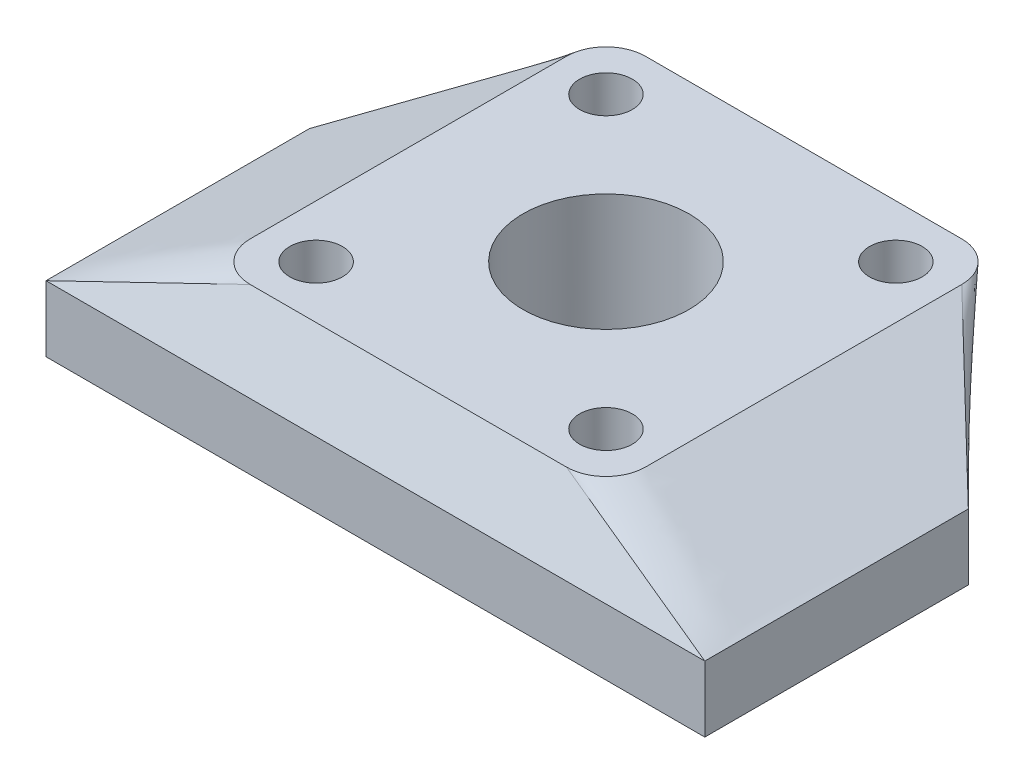
ISO-10303-21;
HEADER;
FILE_DESCRIPTION(('STEP AP214'),'2;1');
FILE_NAME('part.step','',(''),(''),'','','');
FILE_SCHEMA(('AUTOMOTIVE_DESIGN { 1 0 10303 214 1 1 1 1 }'));
ENDSEC;
DATA;
#1=APPLICATION_CONTEXT('core data for automotive mechanical design processes');
#2=APPLICATION_PROTOCOL_DEFINITION('international standard','automotive_design',2000,#1);
#3=PRODUCT_CONTEXT('',#1,'mechanical');
#4=PRODUCT('Part','Part','',(#3));
#5=PRODUCT_RELATED_PRODUCT_CATEGORY('part','',(#4));
#6=PRODUCT_DEFINITION_FORMATION('','',#4);
#7=PRODUCT_DEFINITION_CONTEXT('part definition',#1,'design');
#8=PRODUCT_DEFINITION('design','',#6,#7);
#9=PRODUCT_DEFINITION_SHAPE('','',#8);
#10=(LENGTH_UNIT() NAMED_UNIT(*) SI_UNIT(.MILLI.,.METRE.));
#11=(NAMED_UNIT(*) PLANE_ANGLE_UNIT() SI_UNIT($,.RADIAN.));
#12=(NAMED_UNIT(*) SI_UNIT($,.STERADIAN.) SOLID_ANGLE_UNIT());
#13=UNCERTAINTY_MEASURE_WITH_UNIT(LENGTH_MEASURE(1.E-05),#10,'distance_accuracy_value','');
#14=(GEOMETRIC_REPRESENTATION_CONTEXT(3) GLOBAL_UNCERTAINTY_ASSIGNED_CONTEXT((#13)) GLOBAL_UNIT_ASSIGNED_CONTEXT((#10,
#11,#12)) REPRESENTATION_CONTEXT('',''));
#15=CARTESIAN_POINT('',(0.,0.,0.));
#16=DIRECTION('',(0.,0.,1.));
#17=DIRECTION('',(1.,0.,0.));
#18=AXIS2_PLACEMENT_3D('',#15,#16,#17);
#19=CARTESIAN_POINT('',(-10.,5.,-35.));
#20=DIRECTION('',(0.707106781186547,0.,0.707106781186548));
#21=DIRECTION('',(0.707106781186548,0.,-0.707106781186547));
#22=AXIS2_PLACEMENT_3D('',#19,#20,#21);
#23=PLANE('',#22);
#24=DIRECTION('',(-0.707106781186548,0.,0.707106781186547));
#25=VECTOR('',#24,1.);
#26=CARTESIAN_POINT('',(-10.,0.,-35.));
#27=LINE('',#26,#25);
#28=CARTESIAN_POINT('',(-10.,0.,-35.));
#29=VERTEX_POINT('',#28);
#30=CARTESIAN_POINT('',(-25.,0.,-20.));
#31=VERTEX_POINT('',#30);
#32=EDGE_CURVE('E374',#29,#31,#27,.T.);
#33=ORIENTED_EDGE('',*,*,#32,.T.);
#34=DIRECTION('',(0.,-1.,0.));
#35=VECTOR('',#34,1.);
#36=CARTESIAN_POINT('',(-25.,5.,-20.));
#37=LINE('',#36,#35);
#38=CARTESIAN_POINT('',(-25.,5.,-20.));
#39=VERTEX_POINT('',#38);
#40=EDGE_CURVE('E13',#39,#31,#37,.T.);
#41=ORIENTED_EDGE('',*,*,#40,.F.);
#42=DIRECTION('',(0.707106781186548,0.,-0.707106781186547));
#43=VECTOR('',#42,1.);
#44=CARTESIAN_POINT('',(-10.,5.,-35.));
#45=LINE('',#44,#43);
#46=CARTESIAN_POINT('',(-10.,5.,-35.));
#47=VERTEX_POINT('',#46);
#48=EDGE_CURVE('E491',#47,#39,#45,.F.);
#49=ORIENTED_EDGE('',*,*,#48,.F.);
#50=DIRECTION('',(0.,-1.,0.));
#51=VECTOR('',#50,1.);
#52=CARTESIAN_POINT('',(-10.,5.,-35.));
#53=LINE('',#52,#51);
#54=EDGE_CURVE('E177',#47,#29,#53,.T.);
#55=ORIENTED_EDGE('',*,*,#54,.T.);
#56=EDGE_LOOP('',(#33,#41,#49,#55));
#57=FACE_BOUND('',#56,.T.);
#58=ADVANCED_FACE('F159',(#57),#23,.F.);
#59=CARTESIAN_POINT('',(-25.,5.,-20.));
#60=DIRECTION('',(1.,0.,0.));
#61=DIRECTION('',(0.,0.,-1.));
#62=AXIS2_PLACEMENT_3D('',#59,#60,#61);
#63=PLANE('',#62);
#64=DIRECTION('',(0.,0.,1.));
#65=VECTOR('',#64,1.);
#66=CARTESIAN_POINT('',(-25.,0.,-20.));
#67=LINE('',#66,#65);
#68=CARTESIAN_POINT('',(-25.,0.,0.));
#69=VERTEX_POINT('',#68);
#70=EDGE_CURVE('E544',#31,#69,#67,.T.);
#71=ORIENTED_EDGE('',*,*,#70,.T.);
#72=DIRECTION('',(0.,-1.,0.));
#73=VECTOR('',#72,1.);
#74=CARTESIAN_POINT('',(-25.,5.,0.));
#75=LINE('',#74,#73);
#76=CARTESIAN_POINT('',(-25.,5.,0.));
#77=VERTEX_POINT('',#76);
#78=EDGE_CURVE('E168',#77,#69,#75,.T.);
#79=ORIENTED_EDGE('',*,*,#78,.F.);
#80=DIRECTION('',(0.,0.,-1.));
#81=VECTOR('',#80,1.);
#82=CARTESIAN_POINT('',(-25.,5.,-20.));
#83=LINE('',#82,#81);
#84=EDGE_CURVE('E230',#39,#77,#83,.F.);
#85=ORIENTED_EDGE('',*,*,#84,.F.);
#86=ORIENTED_EDGE('',*,*,#40,.T.);
#87=EDGE_LOOP('',(#71,#79,#85,#86));
#88=FACE_BOUND('',#87,.T.);
#89=ADVANCED_FACE('F557',(#88),#63,.F.);
#90=CARTESIAN_POINT('',(-25.,5.,0.));
#91=DIRECTION('',(0.,0.,-1.));
#92=DIRECTION('',(-1.,0.,0.));
#93=AXIS2_PLACEMENT_3D('',#90,#91,#92);
#94=PLANE('',#93);
#95=DIRECTION('',(1.,0.,0.));
#96=VECTOR('',#95,1.);
#97=CARTESIAN_POINT('',(-25.,0.,0.));
#98=LINE('',#97,#96);
#99=CARTESIAN_POINT('',(25.,0.,0.));
#100=VERTEX_POINT('',#99);
#101=EDGE_CURVE('E204',#69,#100,#98,.T.);
#102=ORIENTED_EDGE('',*,*,#101,.T.);
#103=DIRECTION('',(0.,-1.,0.));
#104=VECTOR('',#103,1.);
#105=CARTESIAN_POINT('',(25.,5.,0.));
#106=LINE('',#105,#104);
#107=CARTESIAN_POINT('',(25.,5.,0.));
#108=VERTEX_POINT('',#107);
#109=EDGE_CURVE('E195',#108,#100,#106,.T.);
#110=ORIENTED_EDGE('',*,*,#109,.F.);
#111=DIRECTION('',(-1.,0.,0.));
#112=VECTOR('',#111,1.);
#113=CARTESIAN_POINT('',(12.,5.,0.));
#114=LINE('',#113,#112);
#115=EDGE_CURVE('E200',#77,#108,#114,.F.);
#116=ORIENTED_EDGE('',*,*,#115,.F.);
#117=ORIENTED_EDGE('',*,*,#78,.T.);
#118=EDGE_LOOP('',(#102,#110,#116,#117));
#119=FACE_BOUND('',#118,.T.);
#120=ADVANCED_FACE('F197',(#119),#94,.F.);
#121=CARTESIAN_POINT('',(25.,5.,0.));
#122=DIRECTION('',(-1.,0.,0.));
#123=DIRECTION('',(0.,0.,1.));
#124=AXIS2_PLACEMENT_3D('',#121,#122,#123);
#125=PLANE('',#124);
#126=DIRECTION('',(0.,0.,-1.));
#127=VECTOR('',#126,1.);
#128=CARTESIAN_POINT('',(25.,0.,0.));
#129=LINE('',#128,#127);
#130=CARTESIAN_POINT('',(25.,0.,-20.));
#131=VERTEX_POINT('',#130);
#132=EDGE_CURVE('E551',#100,#131,#129,.T.);
#133=ORIENTED_EDGE('',*,*,#132,.T.);
#134=DIRECTION('',(0.,-1.,0.));
#135=VECTOR('',#134,1.);
#136=CARTESIAN_POINT('',(25.,5.,-20.));
#137=LINE('',#136,#135);
#138=CARTESIAN_POINT('',(25.,5.,-20.));
#139=VERTEX_POINT('',#138);
#140=EDGE_CURVE('E208',#139,#131,#137,.T.);
#141=ORIENTED_EDGE('',*,*,#140,.F.);
#142=DIRECTION('',(0.,0.,1.));
#143=VECTOR('',#142,1.);
#144=CARTESIAN_POINT('',(25.,5.,0.));
#145=LINE('',#144,#143);
#146=EDGE_CURVE('E212',#108,#139,#145,.F.);
#147=ORIENTED_EDGE('',*,*,#146,.F.);
#148=ORIENTED_EDGE('',*,*,#109,.T.);
#149=EDGE_LOOP('',(#133,#141,#147,#148));
#150=FACE_BOUND('',#149,.T.);
#151=ADVANCED_FACE('F213',(#150),#125,.F.);
#152=CARTESIAN_POINT('',(25.,5.,-20.));
#153=DIRECTION('',(-0.707106781186548,0.,0.707106781186548));
#154=DIRECTION('',(0.707106781186548,0.,0.707106781186548));
#155=AXIS2_PLACEMENT_3D('',#152,#153,#154);
#156=PLANE('',#155);
#157=DIRECTION('',(-0.707106781186547,0.,-0.707106781186547));
#158=VECTOR('',#157,1.);
#159=CARTESIAN_POINT('',(25.,0.,-20.));
#160=LINE('',#159,#158);
#161=CARTESIAN_POINT('',(10.,0.,-35.));
#162=VERTEX_POINT('',#161);
#163=EDGE_CURVE('E539',#131,#162,#160,.T.);
#164=ORIENTED_EDGE('',*,*,#163,.T.);
#165=DIRECTION('',(0.,-1.,0.));
#166=VECTOR('',#165,1.);
#167=CARTESIAN_POINT('',(10.,5.,-35.));
#168=LINE('',#167,#166);
#169=CARTESIAN_POINT('',(10.,5.,-35.));
#170=VERTEX_POINT('',#169);
#171=EDGE_CURVE('E488',#170,#162,#168,.T.);
#172=ORIENTED_EDGE('',*,*,#171,.F.);
#173=DIRECTION('',(0.707106781186548,0.,0.707106781186548));
#174=VECTOR('',#173,1.);
#175=CARTESIAN_POINT('',(25.,5.,-20.));
#176=LINE('',#175,#174);
#177=EDGE_CURVE('E219',#139,#170,#176,.F.);
#178=ORIENTED_EDGE('',*,*,#177,.F.);
#179=ORIENTED_EDGE('',*,*,#140,.T.);
#180=EDGE_LOOP('',(#164,#172,#178,#179));
#181=FACE_BOUND('',#180,.T.);
#182=ADVANCED_FACE('F556',(#181),#156,.F.);
#183=CARTESIAN_POINT('',(10.,5.,-35.));
#184=DIRECTION('',(0.,0.,1.));
#185=DIRECTION('',(1.,0.,0.));
#186=AXIS2_PLACEMENT_3D('',#183,#184,#185);
#187=PLANE('',#186);
#188=DIRECTION('',(-1.,0.,0.));
#189=VECTOR('',#188,1.);
#190=CARTESIAN_POINT('',(10.,0.,-35.));
#191=LINE('',#190,#189);
#192=EDGE_CURVE('E494',#162,#29,#191,.T.);
#193=ORIENTED_EDGE('',*,*,#192,.T.);
#194=ORIENTED_EDGE('',*,*,#54,.F.);
#195=DIRECTION('',(1.,0.,0.));
#196=VECTOR('',#195,1.);
#197=CARTESIAN_POINT('',(-12.,5.,-35.));
#198=LINE('',#197,#196);
#199=EDGE_CURVE('E484',#170,#47,#198,.F.);
#200=ORIENTED_EDGE('',*,*,#199,.F.);
#201=ORIENTED_EDGE('',*,*,#171,.T.);
#202=EDGE_LOOP('',(#193,#194,#200,#201));
#203=FACE_BOUND('',#202,.T.);
#204=ADVANCED_FACE('F535',(#203),#187,.F.);
#205=CARTESIAN_POINT('',(0.,0.,0.));
#206=DIRECTION('',(0.,-1.,0.));
#207=DIRECTION('',(0.,0.,-1.));
#208=AXIS2_PLACEMENT_3D('',#205,#206,#207);
#209=PLANE('',#208);
#210=CARTESIAN_POINT('',(11.,0.,-28.5));
#211=DIRECTION('',(0.,1.,0.));
#212=DIRECTION('',(0.,0.,1.));
#213=AXIS2_PLACEMENT_3D('',#210,#211,#212);
#214=CIRCLE('',#213,2.00000000000001);
#215=CARTESIAN_POINT('',(11.,0.,-26.5));
#216=VERTEX_POINT('',#215);
#217=EDGE_CURVE('E577',#216,#216,#214,.T.);
#218=ORIENTED_EDGE('',*,*,#217,.T.);
#219=EDGE_LOOP('',(#218));
#220=FACE_BOUND('',#219,.T.);
#221=CARTESIAN_POINT('',(-11.,0.,-6.49999999999999));
#222=DIRECTION('',(0.,1.,0.));
#223=DIRECTION('',(0.,0.,1.));
#224=AXIS2_PLACEMENT_3D('',#221,#222,#223);
#225=CIRCLE('',#224,2.);
#226=CARTESIAN_POINT('',(-11.,0.,-4.49999999999999));
#227=VERTEX_POINT('',#226);
#228=EDGE_CURVE('E581',#227,#227,#225,.T.);
#229=ORIENTED_EDGE('',*,*,#228,.T.);
#230=EDGE_LOOP('',(#229));
#231=FACE_BOUND('',#230,.T.);
#232=CARTESIAN_POINT('',(11.,0.,-6.49999999999998));
#233=DIRECTION('',(0.,1.,0.));
#234=DIRECTION('',(0.,0.,1.));
#235=AXIS2_PLACEMENT_3D('',#232,#233,#234);
#236=CIRCLE('',#235,2.);
#237=CARTESIAN_POINT('',(11.,0.,-4.49999999999998));
#238=VERTEX_POINT('',#237);
#239=EDGE_CURVE('E585',#238,#238,#236,.T.);
#240=ORIENTED_EDGE('',*,*,#239,.T.);
#241=EDGE_LOOP('',(#240));
#242=FACE_BOUND('',#241,.T.);
#243=CARTESIAN_POINT('',(0.,0.,-17.5));
#244=DIRECTION('',(0.,1.,0.));
#245=DIRECTION('',(0.,0.,1.));
#246=AXIS2_PLACEMENT_3D('',#243,#244,#245);
#247=CIRCLE('',#246,6.3);
#248=CARTESIAN_POINT('',(0.,0.,-11.2));
#249=VERTEX_POINT('',#248);
#250=EDGE_CURVE('E589',#249,#249,#247,.T.);
#251=ORIENTED_EDGE('',*,*,#250,.T.);
#252=EDGE_LOOP('',(#251));
#253=FACE_BOUND('',#252,.T.);
#254=CARTESIAN_POINT('',(-11.,0.,-28.5));
#255=DIRECTION('',(0.,1.,0.));
#256=DIRECTION('',(0.,0.,1.));
#257=AXIS2_PLACEMENT_3D('',#254,#255,#256);
#258=CIRCLE('',#257,2.);
#259=CARTESIAN_POINT('',(-11.,0.,-26.5));
#260=VERTEX_POINT('',#259);
#261=EDGE_CURVE('E500',#260,#260,#258,.T.);
#262=ORIENTED_EDGE('',*,*,#261,.T.);
#263=EDGE_LOOP('',(#262));
#264=FACE_BOUND('',#263,.T.);
#265=ORIENTED_EDGE('',*,*,#32,.F.);
#266=ORIENTED_EDGE('',*,*,#192,.F.);
#267=ORIENTED_EDGE('',*,*,#163,.F.);
#268=ORIENTED_EDGE('',*,*,#132,.F.);
#269=ORIENTED_EDGE('',*,*,#101,.F.);
#270=ORIENTED_EDGE('',*,*,#70,.F.);
#271=EDGE_LOOP('',(#265,#266,#267,#268,#269,#270));
#272=FACE_BOUND('',#271,.T.);
#273=ADVANCED_FACE('F420',(#220,#231,#242,#253,#264,#272),#209,.T.);
#274=CARTESIAN_POINT('',(-12.,10.,-5.5));
#275=DIRECTION('',(0.,-1.,0.));
#276=DIRECTION('',(0.,0.,-1.));
#277=AXIS2_PLACEMENT_3D('',#274,#275,#276);
#278=PLANE('',#277);
#279=CARTESIAN_POINT('',(11.,10.,-28.5));
#280=DIRECTION('',(0.,-1.,0.));
#281=DIRECTION('',(0.,0.,-1.));
#282=AXIS2_PLACEMENT_3D('',#279,#280,#281);
#283=CIRCLE('',#282,2.00000000000001);
#284=CARTESIAN_POINT('',(11.,10.,-30.5));
#285=VERTEX_POINT('',#284);
#286=EDGE_CURVE('E162',#285,#285,#283,.F.);
#287=ORIENTED_EDGE('',*,*,#286,.F.);
#288=EDGE_LOOP('',(#287));
#289=FACE_BOUND('',#288,.T.);
#290=CARTESIAN_POINT('',(-11.,10.,-6.49999999999999));
#291=DIRECTION('',(0.,-1.,0.));
#292=DIRECTION('',(0.,0.,-1.));
#293=AXIS2_PLACEMENT_3D('',#290,#291,#292);
#294=CIRCLE('',#293,2.);
#295=CARTESIAN_POINT('',(-11.,10.,-8.49999999999999));
#296=VERTEX_POINT('',#295);
#297=EDGE_CURVE('E505',#296,#296,#294,.F.);
#298=ORIENTED_EDGE('',*,*,#297,.F.);
#299=EDGE_LOOP('',(#298));
#300=FACE_BOUND('',#299,.T.);
#301=CARTESIAN_POINT('',(11.,10.,-6.49999999999998));
#302=DIRECTION('',(0.,-1.,0.));
#303=DIRECTION('',(0.,0.,-1.));
#304=AXIS2_PLACEMENT_3D('',#301,#302,#303);
#305=CIRCLE('',#304,2.);
#306=CARTESIAN_POINT('',(11.,10.,-8.49999999999998));
#307=VERTEX_POINT('',#306);
#308=EDGE_CURVE('E503',#307,#307,#305,.F.);
#309=ORIENTED_EDGE('',*,*,#308,.F.);
#310=EDGE_LOOP('',(#309));
#311=FACE_BOUND('',#310,.T.);
#312=CARTESIAN_POINT('',(0.,10.,-17.5));
#313=DIRECTION('',(0.,-1.,0.));
#314=DIRECTION('',(0.,0.,-1.));
#315=AXIS2_PLACEMENT_3D('',#312,#313,#314);
#316=CIRCLE('',#315,6.3);
#317=CARTESIAN_POINT('',(0.,10.,-23.8));
#318=VERTEX_POINT('',#317);
#319=EDGE_CURVE('E499',#318,#318,#316,.F.);
#320=ORIENTED_EDGE('',*,*,#319,.F.);
#321=EDGE_LOOP('',(#320));
#322=FACE_BOUND('',#321,.T.);
#323=CARTESIAN_POINT('',(-11.,10.,-28.5));
#324=DIRECTION('',(0.,-1.,0.));
#325=DIRECTION('',(0.,0.,-1.));
#326=AXIS2_PLACEMENT_3D('',#323,#324,#325);
#327=CIRCLE('',#326,2.);
#328=CARTESIAN_POINT('',(-11.,10.,-30.5));
#329=VERTEX_POINT('',#328);
#330=EDGE_CURVE('E496',#329,#329,#327,.F.);
#331=ORIENTED_EDGE('',*,*,#330,.F.);
#332=EDGE_LOOP('',(#331));
#333=FACE_BOUND('',#332,.T.);
#334=CARTESIAN_POINT('',(-12.,10.,-5.5));
#335=DIRECTION('',(0.,1.,0.));
#336=DIRECTION('',(0.,0.,-1.));
#337=AXIS2_PLACEMENT_3D('',#334,#335,#336);
#338=CIRCLE('',#337,3.);
#339=CARTESIAN_POINT('',(-15.,10.,-5.50000000000002));
#340=VERTEX_POINT('',#339);
#341=CARTESIAN_POINT('',(-12.,10.,-2.5));
#342=VERTEX_POINT('',#341);
#343=EDGE_CURVE('E260',#340,#342,#338,.T.);
#344=ORIENTED_EDGE('',*,*,#343,.T.);
#345=DIRECTION('',(1.,0.,0.));
#346=VECTOR('',#345,1.);
#347=CARTESIAN_POINT('',(12.,10.,-2.5));
#348=LINE('',#347,#346);
#349=CARTESIAN_POINT('',(12.,10.,-2.5));
#350=VERTEX_POINT('',#349);
#351=EDGE_CURVE('E238',#342,#350,#348,.T.);
#352=ORIENTED_EDGE('',*,*,#351,.T.);
#353=CARTESIAN_POINT('',(12.,10.,-5.5));
#354=DIRECTION('',(0.,1.,0.));
#355=DIRECTION('',(0.,0.,1.));
#356=AXIS2_PLACEMENT_3D('',#353,#354,#355);
#357=CIRCLE('',#356,3.);
#358=CARTESIAN_POINT('',(15.,10.,-5.5));
#359=VERTEX_POINT('',#358);
#360=EDGE_CURVE('E236',#350,#359,#357,.T.);
#361=ORIENTED_EDGE('',*,*,#360,.T.);
#362=DIRECTION('',(0.,0.,-1.));
#363=VECTOR('',#362,1.);
#364=CARTESIAN_POINT('',(15.,10.,-5.5));
#365=LINE('',#364,#363);
#366=CARTESIAN_POINT('',(15.,10.,-29.5));
#367=VERTEX_POINT('',#366);
#368=EDGE_CURVE('E380',#359,#367,#365,.T.);
#369=ORIENTED_EDGE('',*,*,#368,.T.);
#370=CARTESIAN_POINT('',(12.,10.,-29.5));
#371=DIRECTION('',(0.,1.,0.));
#372=DIRECTION('',(0.,0.,1.));
#373=AXIS2_PLACEMENT_3D('',#370,#371,#372);
#374=CIRCLE('',#373,3.);
#375=CARTESIAN_POINT('',(12.,10.,-32.5));
#376=VERTEX_POINT('',#375);
#377=EDGE_CURVE('E364',#367,#376,#374,.T.);
#378=ORIENTED_EDGE('',*,*,#377,.T.);
#379=DIRECTION('',(-1.,0.,0.));
#380=VECTOR('',#379,1.);
#381=CARTESIAN_POINT('',(12.,10.,-32.5));
#382=LINE('',#381,#380);
#383=CARTESIAN_POINT('',(-12.,10.,-32.5));
#384=VERTEX_POINT('',#383);
#385=EDGE_CURVE('E470',#376,#384,#382,.T.);
#386=ORIENTED_EDGE('',*,*,#385,.T.);
#387=CARTESIAN_POINT('',(-12.,10.,-29.5));
#388=DIRECTION('',(0.,1.,0.));
#389=DIRECTION('',(0.,0.,1.));
#390=AXIS2_PLACEMENT_3D('',#387,#388,#389);
#391=CIRCLE('',#390,3.);
#392=CARTESIAN_POINT('',(-15.,10.,-29.5));
#393=VERTEX_POINT('',#392);
#394=EDGE_CURVE('E309',#384,#393,#391,.T.);
#395=ORIENTED_EDGE('',*,*,#394,.T.);
#396=DIRECTION('',(0.,0.,1.));
#397=VECTOR('',#396,1.);
#398=CARTESIAN_POINT('',(-15.,10.,-5.50000000000002));
#399=LINE('',#398,#397);
#400=EDGE_CURVE('E462',#393,#340,#399,.T.);
#401=ORIENTED_EDGE('',*,*,#400,.T.);
#402=EDGE_LOOP('',(#344,#352,#361,#369,#378,#386,#395,#401));
#403=FACE_BOUND('',#402,.T.);
#404=ADVANCED_FACE('F411',(#289,#300,#311,#322,#333,#403),#278,.F.);
#405=CARTESIAN_POINT('',(12.,10.,-2.5));
#406=DIRECTION('',(0.,0.447213595499957,0.894427190999916));
#407=DIRECTION('',(-1.,0.,0.));
#408=AXIS2_PLACEMENT_3D('',#405,#406,#407);
#409=PLANE('',#408);
#410=ORIENTED_EDGE('',*,*,#351,.F.);
#411=DIRECTION('',(-0.918664829338845,-0.353332626668786,0.176666313334393));
#412=VECTOR('',#411,1.);
#413=CARTESIAN_POINT('',(-18.5,7.5,-1.25));
#414=LINE('',#413,#412);
#415=EDGE_CURVE('E229',#342,#77,#414,.T.);
#416=ORIENTED_EDGE('',*,*,#415,.T.);
#417=ORIENTED_EDGE('',*,*,#115,.T.);
#418=DIRECTION('',(-0.918664829338845,0.353332626668787,-0.176666313334393));
#419=VECTOR('',#418,1.);
#420=CARTESIAN_POINT('',(18.5,7.5,-1.25000000000001));
#421=LINE('',#420,#419);
#422=EDGE_CURVE('E227',#108,#350,#421,.T.);
#423=ORIENTED_EDGE('',*,*,#422,.T.);
#424=EDGE_LOOP('',(#410,#416,#417,#423));
#425=FACE_BOUND('',#424,.T.);
#426=ADVANCED_FACE('F225',(#425),#409,.T.);
#427=CARTESIAN_POINT('',(-12.,10.,-2.5));
#428=CARTESIAN_POINT('',(-16.3333333333333,8.33333333333333,-1.66666666666667));
#429=CARTESIAN_POINT('',(-20.6666666666667,6.66666666666667,-0.833333333333334));
#430=CARTESIAN_POINT('',(-25.,5.,0.));
#431=CARTESIAN_POINT('',(-12.3812493708699,10.,-2.5));
#432=CARTESIAN_POINT('',(-16.5874995805799,8.33333333333333,-1.7551881230575));
#433=CARTESIAN_POINT('',(-20.79374979029,6.66666666666667,-1.010376246115));
#434=CARTESIAN_POINT('',(-25.,5.,-0.265564369172506));
#435=CARTESIAN_POINT('',(-13.1610339951014,10.,-2.64788074943281));
#436=CARTESIAN_POINT('',(-17.1073559967343,8.33333333333335,-2.02257837781978));
#437=CARTESIAN_POINT('',(-21.0536779983672,6.66666666666667,-1.39727600620674));
#438=CARTESIAN_POINT('',(-25.,5.,-0.771973634593709));
#439=CARTESIAN_POINT('',(-14.1789090711745,9.99999999999998,-3.32109092882553));
#440=CARTESIAN_POINT('',(-17.785939380783,8.33333333333332,-2.71479763529147));
#441=CARTESIAN_POINT('',(-21.3929696903915,6.66666666666666,-2.10850434175741));
#442=CARTESIAN_POINT('',(-25.,5.,-1.50221104822336));
#443=CARTESIAN_POINT('',(-14.8521192505672,10.,-4.33896600489857));
#444=CARTESIAN_POINT('',(-18.2347461670448,8.33333333333335,-3.63679349055005));
#445=CARTESIAN_POINT('',(-21.6173730835224,6.66666666666667,-2.93462097620153));
#446=CARTESIAN_POINT('',(-25.,5.,-2.23244846185301));
#447=CARTESIAN_POINT('',(-15.,10.,-5.11875062913009));
#448=CARTESIAN_POINT('',(-18.3333333333333,8.33333333333333,-4.32545299517813));
#449=CARTESIAN_POINT('',(-21.6666666666667,6.66666666666667,-3.53215536122617));
#450=CARTESIAN_POINT('',(-25.,5.,-2.73885772727421));
#451=CARTESIAN_POINT('',(-15.,10.,-7.51144970834818));
#452=CARTESIAN_POINT('',(-18.3333333333333,8.33333333333333,-6.47614127021241));
#453=CARTESIAN_POINT('',(-21.6666666666667,6.66666666666667,-5.44083283207665));
#454=CARTESIAN_POINT('',(-25.,5.,-4.40552439394088));
#455=CARTESIAN_POINT('',(-15.,10.,-11.5170299213761));
#456=CARTESIAN_POINT('',(-18.3333333333333,8.33333333333334,-10.0880722051949));
#457=CARTESIAN_POINT('',(-21.6666666666667,6.66666666666667,-8.65911448901373));
#458=CARTESIAN_POINT('',(-25.,5.,-7.23015677283255));
#459=CARTESIAN_POINT('',(-15.,9.99999999999999,-17.5));
#460=CARTESIAN_POINT('',(-18.3333333333333,8.33333333333333,-15.5007370160745));
#461=CARTESIAN_POINT('',(-21.6666666666667,6.66666666666666,-13.5014740321489));
#462=CARTESIAN_POINT('',(-25.,5.,-11.5022110482234));
#463=CARTESIAN_POINT('',(-15.,10.,-23.4829700786239));
#464=CARTESIAN_POINT('',(-18.3333333333333,8.33333333333334,-20.913401826954));
#465=CARTESIAN_POINT('',(-21.6666666666667,6.66666666666667,-18.3438335752841));
#466=CARTESIAN_POINT('',(-25.,5.,-15.7742653236142));
#467=CARTESIAN_POINT('',(-15.,10.,-27.4885502916518));
#468=CARTESIAN_POINT('',(-18.3333333333333,8.33333333333333,-24.5253327619365));
#469=CARTESIAN_POINT('',(-21.6666666666667,6.66666666666667,-21.5621152322212));
#470=CARTESIAN_POINT('',(-25.,5.,-18.5988977025058));
#471=CARTESIAN_POINT('',(-15.,10.,-29.5));
#472=CARTESIAN_POINT('',(-18.3333333333333,8.33333333333333,-26.3333333333333));
#473=CARTESIAN_POINT('',(-21.6666666666667,6.66666666666667,-23.1666666666667));
#474=CARTESIAN_POINT('',(-25.,5.,-20.));
#475=B_SPLINE_SURFACE_WITH_KNOTS('',3,3,((#427,#428,#429,#430),(#431,#432,#433,#434),(#435,#436,
#437,#438),(#439,#440,#441,#442),(#443,#444,#445,#446),(#447,#448,#449,#450),(#451,#452,#453,
#454),(#455,#456,#457,#458),(#459,#460,#461,#462),(#463,#464,#465,#466),(#467,#468,#469,#470),
(#471,#472,#473,#474)),.UNSPECIFIED.,.F.,.F.,.F.,(4,1,1,1,2,1,1,1,4),(4,4),(0.,
0.0398346553758758,0.0796693107517516,0.119503966127627,0.159338621503503,0.369503966127627,
0.579669310751752,0.789834655375876,1.),(0.,1.),.UNSPECIFIED.);
#476=DIRECTION('',(-0.681598176590998,-0.340799088295499,0.647518267761446));
#477=VECTOR('',#476,1.);
#478=CARTESIAN_POINT('',(-20.,7.5,-24.75));
#479=LINE('',#478,#477);
#480=EDGE_CURVE('E240',#393,#39,#479,.T.);
#481=CARTESIAN_POINT('',(-11.999831,10.000065,-2.5000325));
#482=CARTESIAN_POINT('',(-11.9998873333333,10.0000433333333,-2.50002166666667));
#483=CARTESIAN_POINT('',(-11.9999436666666,10.0000216666667,-2.50001083333334));
#484=CARTESIAN_POINT('',(-12.,10.,-2.5));
#485=CARTESIAN_POINT('',(-16.3333333333333,8.33333333333333,-1.66666666666667));
#486=CARTESIAN_POINT('',(-20.6666666666667,6.66666666666667,-0.833333333333334));
#487=CARTESIAN_POINT('',(-25.,5.,0.));
#488=CARTESIAN_POINT('',(-12.3810853271117,10.000065,-2.5000290476632));
#489=CARTESIAN_POINT('',(-12.3811400083645,10.0000433333333,-2.5000193651088));
#490=CARTESIAN_POINT('',(-12.3811946896172,10.0000216666667,-2.5000096825544));
#491=CARTESIAN_POINT('',(-12.3812493708699,10.,-2.5));
#492=CARTESIAN_POINT('',(-16.5874995805799,8.33333333333333,-1.7551881230575));
#493=CARTESIAN_POINT('',(-20.79374979029,6.66666666666667,-1.010376246115));
#494=CARTESIAN_POINT('',(-25.,5.,-0.265564369172506));
#495=CARTESIAN_POINT('',(-13.1608800885434,10.000065,-2.64790513622531));
#496=CARTESIAN_POINT('',(-13.1609313907294,10.0000433333334,-2.64789700729448));
#497=CARTESIAN_POINT('',(-13.1609826929154,10.0000216666667,-2.64788887836364));
#498=CARTESIAN_POINT('',(-13.1610339951014,10.,-2.64788074943281));
#499=CARTESIAN_POINT('',(-17.1073559967343,8.33333333333335,-2.02257837781978));
#500=CARTESIAN_POINT('',(-21.0536779983672,6.66666666666667,-1.39727600620674));
#501=CARTESIAN_POINT('',(-25.,5.,-0.771973634593709));
#502=CARTESIAN_POINT('',(-14.1787683969924,10.000065,-3.32111457426397));
#503=CARTESIAN_POINT('',(-14.1788152883864,10.0000433333333,-3.32110669245116));
#504=CARTESIAN_POINT('',(-14.1788621797805,10.0000216666666,-3.32109881063834));
#505=CARTESIAN_POINT('',(-14.1789090711745,9.99999999999998,-3.32109092882553));
#506=CARTESIAN_POINT('',(-17.785939380783,8.33333333333332,-2.71479763529147));
#507=CARTESIAN_POINT('',(-21.3929696903915,6.66666666666666,-2.10850434175741));
#508=CARTESIAN_POINT('',(-25.,5.,-1.50221104822336));
#509=CARTESIAN_POINT('',(-14.8519873281175,10.000065,-4.33899338962663));
#510=CARTESIAN_POINT('',(-14.8520313022674,10.0000433333334,-4.33898426138394));
#511=CARTESIAN_POINT('',(-14.8520752764173,10.0000216666667,-4.33897513314126));
#512=CARTESIAN_POINT('',(-14.8521192505672,10.,-4.33896600489857));
#513=CARTESIAN_POINT('',(-18.2347461670448,8.33333333333335,-3.63679349055005));
#514=CARTESIAN_POINT('',(-21.6173730835224,6.66666666666667,-2.93462097620153));
#515=CARTESIAN_POINT('',(-25.,5.,-2.23244846185301));
#516=CARTESIAN_POINT('',(-14.99987,10.000065,-5.11878156773782));
#517=CARTESIAN_POINT('',(-14.9999133333333,10.0000433333333,-5.11877125486858));
#518=CARTESIAN_POINT('',(-14.9999566666667,10.0000216666667,-5.11876094199934));
#519=CARTESIAN_POINT('',(-15.,10.,-5.11875062913009));
#520=CARTESIAN_POINT('',(-18.3333333333333,8.33333333333333,-4.32545299517813));
#521=CARTESIAN_POINT('',(-21.6666666666667,6.66666666666667,-3.53215536122617));
#522=CARTESIAN_POINT('',(-25.,5.,-2.73885772727421));
#523=CARTESIAN_POINT('',(-14.99987,10.000065,-7.51149008537726));
#524=CARTESIAN_POINT('',(-14.9999133333333,10.0000433333333,-7.51147662636757));
#525=CARTESIAN_POINT('',(-14.9999566666667,10.0000216666667,-7.51146316735787));
#526=CARTESIAN_POINT('',(-15.,10.,-7.51144970834818));
#527=CARTESIAN_POINT('',(-18.3333333333333,8.33333333333333,-6.47614127021241));
#528=CARTESIAN_POINT('',(-21.6666666666667,6.66666666666667,-5.44083283207665));
#529=CARTESIAN_POINT('',(-25.,5.,-4.40552439394088));
#530=CARTESIAN_POINT('',(-14.99987,10.000065,-11.517085650727));
#531=CARTESIAN_POINT('',(-14.9999133333334,10.0000433333333,-11.5170670742767));
#532=CARTESIAN_POINT('',(-14.9999566666667,10.0000216666667,-11.5170484978264));
#533=CARTESIAN_POINT('',(-15.,10.,-11.5170299213761));
#534=CARTESIAN_POINT('',(-18.3333333333333,8.33333333333334,-10.0880722051949));
#535=CARTESIAN_POINT('',(-21.6666666666667,6.66666666666667,-8.65911448901373));
#536=CARTESIAN_POINT('',(-25.,5.,-7.23015677283255));
#537=CARTESIAN_POINT('',(-14.99987,10.000065,-17.5000779712564));
#538=CARTESIAN_POINT('',(-14.9999133333333,10.0000433333333,-17.5000519808376));
#539=CARTESIAN_POINT('',(-14.9999566666667,10.0000216666667,-17.5000259904188));
#540=CARTESIAN_POINT('',(-15.,9.99999999999999,-17.5));
#541=CARTESIAN_POINT('',(-18.3333333333333,8.33333333333333,-15.5007370160745));
#542=CARTESIAN_POINT('',(-21.6666666666667,6.66666666666666,-13.5014740321489));
#543=CARTESIAN_POINT('',(-25.,5.,-11.5022110482234));
#544=CARTESIAN_POINT('',(-14.99987,10.000065,-23.4830702917857));
#545=CARTESIAN_POINT('',(-14.9999133333333,10.0000433333333,-23.4830368873984));
#546=CARTESIAN_POINT('',(-14.9999566666667,10.0000216666667,-23.4830034830112));
#547=CARTESIAN_POINT('',(-15.,10.,-23.4829700786239));
#548=CARTESIAN_POINT('',(-18.3333333333333,8.33333333333334,-20.913401826954));
#549=CARTESIAN_POINT('',(-21.6666666666667,6.66666666666667,-18.3438335752841));
#550=CARTESIAN_POINT('',(-25.,5.,-15.7742653236142));
#551=CARTESIAN_POINT('',(-14.99987,10.000065,-27.4886658571355));
#552=CARTESIAN_POINT('',(-14.9999133333333,10.0000433333333,-27.4886273353076));
#553=CARTESIAN_POINT('',(-14.9999566666667,10.0000216666667,-27.4885888134797));
#554=CARTESIAN_POINT('',(-15.,10.,-27.4885502916518));
#555=CARTESIAN_POINT('',(-18.3333333333333,8.33333333333333,-24.5253327619365));
#556=CARTESIAN_POINT('',(-21.6666666666667,6.66666666666667,-21.5621152322212));
#557=CARTESIAN_POINT('',(-25.,5.,-18.5988977025058));
#558=CARTESIAN_POINT('',(-14.99987,10.000065,-29.5001235));
#559=CARTESIAN_POINT('',(-14.9999133333333,10.0000433333333,-29.5000823333333));
#560=CARTESIAN_POINT('',(-14.9999566666667,10.0000216666667,-29.5000411666666));
#561=CARTESIAN_POINT('',(-15.,10.,-29.5));
#562=CARTESIAN_POINT('',(-18.3333333333333,8.33333333333333,-26.3333333333333));
#563=CARTESIAN_POINT('',(-21.6666666666667,6.66666666666667,-23.1666666666667));
#564=CARTESIAN_POINT('',(-25.,5.,-20.));
#565=B_SPLINE_SURFACE_WITH_KNOTS('',3,3,((#481,#482,#483,#484,#485,#486,#487),(#488,#489,#490,
#491,#492,#493,#494),(#495,#496,#497,#498,#499,#500,#501),(#502,#503,#504,#505,#506,#507,#508),
(#509,#510,#511,#512,#513,#514,#515),(#516,#517,#518,#519,#520,#521,#522),(#523,#524,#525,#526,
#527,#528,#529),(#530,#531,#532,#533,#534,#535,#536),(#537,#538,#539,#540,#541,#542,#543),(#544,
#545,#546,#547,#548,#549,#550),(#551,#552,#553,#554,#555,#556,#557),(#558,#559,#560,#561,#562,
#563,#564)),.UNSPECIFIED.,.F.,.F.,.F.,(4,1,1,1,2,1,1,1,4),(4,3,4),(0.,0.0398346553758758,
0.0796693107517516,0.119503966127627,0.159338621503503,0.369503966127627,0.579669310751752,
0.789834655375876,1.),(-1.3E-05,0.,1.),.UNSPECIFIED.);
#566=ORIENTED_EDGE('',*,*,#343,.F.);
#567=ORIENTED_EDGE('',*,*,#400,.F.);
#568=ORIENTED_EDGE('',*,*,#480,.T.);
#569=ORIENTED_EDGE('',*,*,#84,.T.);
#570=ORIENTED_EDGE('',*,*,#415,.F.);
#571=EDGE_LOOP('',(#566,#567,#568,#569,#570));
#572=FACE_BOUND('',#571,.T.);
#573=ADVANCED_FACE('F266',(#572),#565,.T.);
#574=CARTESIAN_POINT('',(15.,10.,-29.5));
#575=CARTESIAN_POINT('',(18.3333333333333,8.33333333333333,-26.3333333333333));
#576=CARTESIAN_POINT('',(21.6666666666667,6.66666666666667,-23.1666666666667));
#577=CARTESIAN_POINT('',(25.,5.,-20.));
#578=CARTESIAN_POINT('',(15.,10.,-27.4885502916518));
#579=CARTESIAN_POINT('',(18.3333333333333,8.33333333333333,-24.5253327619365));
#580=CARTESIAN_POINT('',(21.6666666666667,6.66666666666667,-21.5621152322212));
#581=CARTESIAN_POINT('',(25.,5.,-18.5988977025058));
#582=CARTESIAN_POINT('',(15.,10.,-23.4829700786239));
#583=CARTESIAN_POINT('',(18.3333333333333,8.33333333333334,-20.913401826954));
#584=CARTESIAN_POINT('',(21.6666666666667,6.66666666666667,-18.3438335752841));
#585=CARTESIAN_POINT('',(25.,5.00000000000001,-15.7742653236142));
#586=CARTESIAN_POINT('',(15.,9.99999999999999,-17.5));
#587=CARTESIAN_POINT('',(18.3333333333333,8.33333333333333,-15.5007370160744));
#588=CARTESIAN_POINT('',(21.6666666666667,6.66666666666666,-13.5014740321489));
#589=CARTESIAN_POINT('',(25.,4.99999999999999,-11.5022110482233));
#590=CARTESIAN_POINT('',(15.,10.,-11.5170299213761));
#591=CARTESIAN_POINT('',(18.3333333333333,8.33333333333334,-10.0880722051949));
#592=CARTESIAN_POINT('',(21.6666666666667,6.66666666666667,-8.65911448901373));
#593=CARTESIAN_POINT('',(25.,5.,-7.23015677283257));
#594=CARTESIAN_POINT('',(15.,10.,-7.51144970834816));
#595=CARTESIAN_POINT('',(18.3333333333333,8.33333333333333,-6.47614127021239));
#596=CARTESIAN_POINT('',(21.6666666666667,6.66666666666667,-5.44083283207663));
#597=CARTESIAN_POINT('',(25.,5.,-4.40552439394087));
#598=CARTESIAN_POINT('',(15.,10.,-5.11875062913008));
#599=CARTESIAN_POINT('',(18.3333333333333,8.33333333333333,-4.32545299517812));
#600=CARTESIAN_POINT('',(21.6666666666667,6.66666666666667,-3.53215536122616));
#601=CARTESIAN_POINT('',(25.,5.,-2.7388577272742));
#602=CARTESIAN_POINT('',(14.8521192505672,10.,-4.33896600489854));
#603=CARTESIAN_POINT('',(18.2347461670448,8.33333333333334,-3.63679349055003));
#604=CARTESIAN_POINT('',(21.6173730835224,6.66666666666667,-2.93462097620152));
#605=CARTESIAN_POINT('',(25.,5.00000000000001,-2.23244846185301));
#606=CARTESIAN_POINT('',(14.1789090711745,9.99999999999998,-3.32109092882554));
#607=CARTESIAN_POINT('',(17.785939380783,8.33333333333332,-2.71479763529148));
#608=CARTESIAN_POINT('',(21.3929696903915,6.66666666666666,-2.10850434175742));
#609=CARTESIAN_POINT('',(25.,4.99999999999999,-1.50221104822336));
#610=CARTESIAN_POINT('',(13.1610339951014,10.,-2.64788074943281));
#611=CARTESIAN_POINT('',(17.1073559967343,8.33333333333334,-2.02257837781978));
#612=CARTESIAN_POINT('',(21.0536779983671,6.66666666666667,-1.39727600620674));
#613=CARTESIAN_POINT('',(25.,5.,-0.771973634593712));
#614=CARTESIAN_POINT('',(12.3812493708699,10.,-2.5));
#615=CARTESIAN_POINT('',(16.58749958058,8.33333333333333,-1.75518812305751));
#616=CARTESIAN_POINT('',(20.79374979029,6.66666666666667,-1.01037624611501));
#617=CARTESIAN_POINT('',(25.,5.,-0.265564369172513));
#618=CARTESIAN_POINT('',(12.,10.,-2.5));
#619=CARTESIAN_POINT('',(16.3333333333333,8.33333333333333,-1.66666666666667));
#620=CARTESIAN_POINT('',(20.6666666666667,6.66666666666667,-0.83333333333334));
#621=CARTESIAN_POINT('',(25.,5.,0.));
#622=B_SPLINE_SURFACE_WITH_KNOTS('',3,3,((#574,#575,#576,#577),(#578,#579,#580,#581),(#582,#583,
#584,#585),(#586,#587,#588,#589),(#590,#591,#592,#593),(#594,#595,#596,#597),(#598,#599,#600,
#601),(#602,#603,#604,#605),(#606,#607,#608,#609),(#610,#611,#612,#613),(#614,#615,#616,#617),
(#618,#619,#620,#621)),.UNSPECIFIED.,.F.,.F.,.F.,(4,1,1,1,2,1,1,1,4),(4,4),(0.,
0.210165344624124,0.420330689248249,0.630496033872373,0.840661378496498,0.880496033872373,
0.920330689248249,0.960165344624125,1.),(0.,1.),.UNSPECIFIED.);
#623=DIRECTION('',(0.681598176590997,-0.340799088295499,0.647518267761447));
#624=VECTOR('',#623,1.);
#625=CARTESIAN_POINT('',(20.,7.5,-24.75));
#626=LINE('',#625,#624);
#627=EDGE_CURVE('E355',#367,#139,#626,.T.);
#628=CARTESIAN_POINT('',(14.99987,10.000065,-29.5001235));
#629=CARTESIAN_POINT('',(14.9999133333333,10.0000433333333,-29.5000823333333));
#630=CARTESIAN_POINT('',(14.9999566666667,10.0000216666667,-29.5000411666667));
#631=CARTESIAN_POINT('',(15.,10.,-29.5));
#632=CARTESIAN_POINT('',(18.3333333333333,8.33333333333333,-26.3333333333333));
#633=CARTESIAN_POINT('',(21.6666666666667,6.66666666666667,-23.1666666666667));
#634=CARTESIAN_POINT('',(25.,5.,-20.));
#635=CARTESIAN_POINT('',(14.99987,10.000065,-27.4886658571355));
#636=CARTESIAN_POINT('',(14.9999133333333,10.0000433333333,-27.4886273353076));
#637=CARTESIAN_POINT('',(14.9999566666667,10.0000216666667,-27.4885888134797));
#638=CARTESIAN_POINT('',(15.,10.,-27.4885502916518));
#639=CARTESIAN_POINT('',(18.3333333333333,8.33333333333333,-24.5253327619365));
#640=CARTESIAN_POINT('',(21.6666666666667,6.66666666666667,-21.5621152322212));
#641=CARTESIAN_POINT('',(25.,5.,-18.5988977025058));
#642=CARTESIAN_POINT('',(14.99987,10.000065,-23.4830702917857));
#643=CARTESIAN_POINT('',(14.9999133333333,10.0000433333333,-23.4830368873985));
#644=CARTESIAN_POINT('',(14.9999566666667,10.0000216666667,-23.4830034830112));
#645=CARTESIAN_POINT('',(15.,10.,-23.4829700786239));
#646=CARTESIAN_POINT('',(18.3333333333333,8.33333333333334,-20.913401826954));
#647=CARTESIAN_POINT('',(21.6666666666667,6.66666666666667,-18.3438335752841));
#648=CARTESIAN_POINT('',(25.,5.00000000000001,-15.7742653236142));
#649=CARTESIAN_POINT('',(14.99987,10.000065,-17.5000779712564));
#650=CARTESIAN_POINT('',(14.9999133333333,10.0000433333333,-17.5000519808376));
#651=CARTESIAN_POINT('',(14.9999566666667,10.0000216666667,-17.5000259904188));
#652=CARTESIAN_POINT('',(15.,9.99999999999999,-17.5));
#653=CARTESIAN_POINT('',(18.3333333333333,8.33333333333333,-15.5007370160744));
#654=CARTESIAN_POINT('',(21.6666666666667,6.66666666666666,-13.5014740321489));
#655=CARTESIAN_POINT('',(25.,4.99999999999999,-11.5022110482233));
#656=CARTESIAN_POINT('',(14.99987,10.000065,-11.517085650727));
#657=CARTESIAN_POINT('',(14.9999133333334,10.0000433333333,-11.5170670742767));
#658=CARTESIAN_POINT('',(14.9999566666667,10.0000216666667,-11.5170484978264));
#659=CARTESIAN_POINT('',(15.,10.,-11.5170299213761));
#660=CARTESIAN_POINT('',(18.3333333333333,8.33333333333334,-10.0880722051949));
#661=CARTESIAN_POINT('',(21.6666666666667,6.66666666666667,-8.65911448901373));
#662=CARTESIAN_POINT('',(25.,5.,-7.23015677283257));
#663=CARTESIAN_POINT('',(14.99987,10.000065,-7.51149008537724));
#664=CARTESIAN_POINT('',(14.9999133333333,10.0000433333333,-7.51147662636755));
#665=CARTESIAN_POINT('',(14.9999566666667,10.0000216666667,-7.51146316735785));
#666=CARTESIAN_POINT('',(15.,10.,-7.51144970834816));
#667=CARTESIAN_POINT('',(18.3333333333333,8.33333333333333,-6.47614127021239));
#668=CARTESIAN_POINT('',(21.6666666666667,6.66666666666667,-5.44083283207663));
#669=CARTESIAN_POINT('',(25.,5.,-4.40552439394087));
#670=CARTESIAN_POINT('',(14.99987,10.000065,-5.1187815677378));
#671=CARTESIAN_POINT('',(14.9999133333333,10.0000433333333,-5.11877125486856));
#672=CARTESIAN_POINT('',(14.9999566666667,10.0000216666667,-5.11876094199932));
#673=CARTESIAN_POINT('',(15.,10.,-5.11875062913008));
#674=CARTESIAN_POINT('',(18.3333333333333,8.33333333333333,-4.32545299517812));
#675=CARTESIAN_POINT('',(21.6666666666667,6.66666666666667,-3.53215536122616));
#676=CARTESIAN_POINT('',(25.,5.,-2.7388577272742));
#677=CARTESIAN_POINT('',(14.8519873281174,10.000065,-4.3389933896266));
#678=CARTESIAN_POINT('',(14.8520313022673,10.0000433333333,-4.33898426138392));
#679=CARTESIAN_POINT('',(14.8520752764173,10.0000216666667,-4.33897513314123));
#680=CARTESIAN_POINT('',(14.8521192505672,10.,-4.33896600489854));
#681=CARTESIAN_POINT('',(18.2347461670448,8.33333333333334,-3.63679349055003));
#682=CARTESIAN_POINT('',(21.6173730835224,6.66666666666667,-2.93462097620152));
#683=CARTESIAN_POINT('',(25.,5.00000000000001,-2.23244846185301));
#684=CARTESIAN_POINT('',(14.1787683969924,10.000065,-3.32111457426399));
#685=CARTESIAN_POINT('',(14.1788152883864,10.0000433333333,-3.32110669245117));
#686=CARTESIAN_POINT('',(14.1788621797805,10.0000216666667,-3.32109881063836));
#687=CARTESIAN_POINT('',(14.1789090711745,9.99999999999998,-3.32109092882554));
#688=CARTESIAN_POINT('',(17.785939380783,8.33333333333332,-2.71479763529148));
#689=CARTESIAN_POINT('',(21.3929696903915,6.66666666666666,-2.10850434175742));
#690=CARTESIAN_POINT('',(25.,4.99999999999999,-1.50221104822336));
#691=CARTESIAN_POINT('',(13.1608800885434,10.000065,-2.6479051362253));
#692=CARTESIAN_POINT('',(13.1609313907294,10.0000433333333,-2.64789700729447));
#693=CARTESIAN_POINT('',(13.1609826929154,10.0000216666667,-2.64788887836364));
#694=CARTESIAN_POINT('',(13.1610339951014,10.,-2.64788074943281));
#695=CARTESIAN_POINT('',(17.1073559967343,8.33333333333334,-2.02257837781978));
#696=CARTESIAN_POINT('',(21.0536779983671,6.66666666666667,-1.39727600620674));
#697=CARTESIAN_POINT('',(25.,5.,-0.771973634593712));
#698=CARTESIAN_POINT('',(12.3810853271118,10.000065,-2.5000290476632));
#699=CARTESIAN_POINT('',(12.3811400083645,10.0000433333333,-2.5000193651088));
#700=CARTESIAN_POINT('',(12.3811946896172,10.0000216666667,-2.5000096825544));
#701=CARTESIAN_POINT('',(12.3812493708699,10.,-2.5));
#702=CARTESIAN_POINT('',(16.58749958058,8.33333333333333,-1.75518812305751));
#703=CARTESIAN_POINT('',(20.79374979029,6.66666666666667,-1.01037624611501));
#704=CARTESIAN_POINT('',(25.,5.,-0.265564369172513));
#705=CARTESIAN_POINT('',(11.999831,10.000065,-2.5000325));
#706=CARTESIAN_POINT('',(11.9998873333333,10.0000433333333,-2.50002166666667));
#707=CARTESIAN_POINT('',(11.9999436666667,10.0000216666667,-2.50001083333333));
#708=CARTESIAN_POINT('',(12.,10.,-2.5));
#709=CARTESIAN_POINT('',(16.3333333333333,8.33333333333333,-1.66666666666667));
#710=CARTESIAN_POINT('',(20.6666666666667,6.66666666666667,-0.83333333333334));
#711=CARTESIAN_POINT('',(25.,5.,0.));
#712=B_SPLINE_SURFACE_WITH_KNOTS('',3,3,((#628,#629,#630,#631,#632,#633,#634),(#635,#636,#637,
#638,#639,#640,#641),(#642,#643,#644,#645,#646,#647,#648),(#649,#650,#651,#652,#653,#654,#655),
(#656,#657,#658,#659,#660,#661,#662),(#663,#664,#665,#666,#667,#668,#669),(#670,#671,#672,#673,
#674,#675,#676),(#677,#678,#679,#680,#681,#682,#683),(#684,#685,#686,#687,#688,#689,#690),(#691,
#692,#693,#694,#695,#696,#697),(#698,#699,#700,#701,#702,#703,#704),(#705,#706,#707,#708,#709,
#710,#711)),.UNSPECIFIED.,.F.,.F.,.F.,(4,1,1,1,2,1,1,1,4),(4,3,4),(0.,0.210165344624124,
0.420330689248249,0.630496033872373,0.840661378496498,0.880496033872373,0.920330689248249,
0.960165344624125,1.),(-1.3E-05,0.,1.),.UNSPECIFIED.);
#713=ORIENTED_EDGE('',*,*,#368,.F.);
#714=ORIENTED_EDGE('',*,*,#360,.F.);
#715=ORIENTED_EDGE('',*,*,#422,.F.);
#716=ORIENTED_EDGE('',*,*,#146,.T.);
#717=ORIENTED_EDGE('',*,*,#627,.F.);
#718=EDGE_LOOP('',(#713,#714,#715,#716,#717));
#719=FACE_BOUND('',#718,.T.);
#720=ADVANCED_FACE('F234',(#719),#712,.T.);
#721=CARTESIAN_POINT('',(-15.,10.,-29.5));
#722=CARTESIAN_POINT('',(-18.3333333333333,8.33333333333333,-26.3333333333333));
#723=CARTESIAN_POINT('',(-21.6666666666667,6.66666666666667,-23.1666666666667));
#724=CARTESIAN_POINT('',(-25.,5.,-20.));
#725=CARTESIAN_POINT('',(-15.,10.,-31.1557450297693));
#726=CARTESIAN_POINT('',(-16.6666666666667,8.33333333333333,-29.1038300198462));
#727=CARTESIAN_POINT('',(-18.3333333333333,6.66666666666667,-27.0519150099231));
#728=CARTESIAN_POINT('',(-20.,5.,-25.));
#729=CARTESIAN_POINT('',(-13.6557450297693,10.,-32.5));
#730=CARTESIAN_POINT('',(-14.1038300198462,8.33333333333333,-31.6666666666667));
#731=CARTESIAN_POINT('',(-14.5519150099231,6.66666666666667,-30.8333333333333));
#732=CARTESIAN_POINT('',(-15.,5.,-30.));
#733=CARTESIAN_POINT('',(-12.,10.,-32.5));
#734=CARTESIAN_POINT('',(-11.3333333333333,8.33333333333333,-33.3333333333333));
#735=CARTESIAN_POINT('',(-10.6666666666667,6.66666666666667,-34.1666666666667));
#736=CARTESIAN_POINT('',(-10.,5.,-35.));
#737=B_SPLINE_SURFACE_WITH_KNOTS('',3,3,((#721,#722,#723,#724),(#725,#726,#727,#728),(#729,#730,
#731,#732),(#733,#734,#735,#736)),.UNSPECIFIED.,.F.,.F.,.F.,(4,4),(4,4),(0.,1.),(0.,1.),.UNSPECIFIED.);
#738=DIRECTION('',(0.336860768426605,-0.84215192106652,-0.421075960533259));
#739=VECTOR('',#738,1.);
#740=CARTESIAN_POINT('',(-11.,7.5,-33.75));
#741=LINE('',#740,#739);
#742=EDGE_CURVE('E299',#384,#47,#741,.T.);
#743=ORIENTED_EDGE('',*,*,#394,.F.);
#744=ORIENTED_EDGE('',*,*,#742,.T.);
#745=ORIENTED_EDGE('',*,*,#48,.T.);
#746=ORIENTED_EDGE('',*,*,#480,.F.);
#747=EDGE_LOOP('',(#743,#744,#745,#746));
#748=FACE_BOUND('',#747,.T.);
#749=ADVANCED_FACE('F315',(#748),#737,.T.);
#750=CARTESIAN_POINT('',(-12.,10.,-32.5));
#751=DIRECTION('',(0.,0.447213595499958,-0.894427190999916));
#752=DIRECTION('',(1.,0.,0.));
#753=AXIS2_PLACEMENT_3D('',#750,#751,#752);
#754=PLANE('',#753);
#755=ORIENTED_EDGE('',*,*,#385,.F.);
#756=DIRECTION('',(-0.336860768426608,-0.842151921066518,-0.421075960533262));
#757=VECTOR('',#756,1.);
#758=CARTESIAN_POINT('',(11.,7.5,-33.75));
#759=LINE('',#758,#757);
#760=EDGE_CURVE('E347',#376,#170,#759,.T.);
#761=ORIENTED_EDGE('',*,*,#760,.T.);
#762=ORIENTED_EDGE('',*,*,#199,.T.);
#763=ORIENTED_EDGE('',*,*,#742,.F.);
#764=EDGE_LOOP('',(#755,#761,#762,#763));
#765=FACE_BOUND('',#764,.T.);
#766=ADVANCED_FACE('F326',(#765),#754,.T.);
#767=CARTESIAN_POINT('',(12.,10.,-32.5));
#768=CARTESIAN_POINT('',(11.3333333333333,8.33333333333333,-33.3333333333333));
#769=CARTESIAN_POINT('',(10.6666666666667,6.66666666666667,-34.1666666666667));
#770=CARTESIAN_POINT('',(10.,5.,-35.));
#771=CARTESIAN_POINT('',(13.6557450297693,10.,-32.5));
#772=CARTESIAN_POINT('',(14.1038300198462,8.33333333333333,-31.6666666666667));
#773=CARTESIAN_POINT('',(14.5519150099231,6.66666666666667,-30.8333333333333));
#774=CARTESIAN_POINT('',(15.,5.,-30.));
#775=CARTESIAN_POINT('',(15.,10.,-31.1557450297693));
#776=CARTESIAN_POINT('',(16.6666666666667,8.33333333333333,-29.1038300198462));
#777=CARTESIAN_POINT('',(18.3333333333333,6.66666666666667,-27.0519150099231));
#778=CARTESIAN_POINT('',(20.,5.,-25.));
#779=CARTESIAN_POINT('',(15.,10.,-29.5));
#780=CARTESIAN_POINT('',(18.3333333333333,8.33333333333333,-26.3333333333333));
#781=CARTESIAN_POINT('',(21.6666666666667,6.66666666666667,-23.1666666666667));
#782=CARTESIAN_POINT('',(25.,5.,-20.));
#783=B_SPLINE_SURFACE_WITH_KNOTS('',3,3,((#767,#768,#769,#770),(#771,#772,#773,#774),(#775,#776,
#777,#778),(#779,#780,#781,#782)),.UNSPECIFIED.,.F.,.F.,.F.,(4,4),(4,4),(0.,1.),(0.,1.),.UNSPECIFIED.);
#784=ORIENTED_EDGE('',*,*,#377,.F.);
#785=ORIENTED_EDGE('',*,*,#627,.T.);
#786=ORIENTED_EDGE('',*,*,#177,.T.);
#787=ORIENTED_EDGE('',*,*,#760,.F.);
#788=EDGE_LOOP('',(#784,#785,#786,#787));
#789=FACE_BOUND('',#788,.T.);
#790=ADVANCED_FACE('F335',(#789),#783,.T.);
#791=CARTESIAN_POINT('',(-11.,10.0073527205678,-28.5));
#792=DIRECTION('',(0.,-1.,0.));
#793=DIRECTION('',(0.,0.,-1.));
#794=AXIS2_PLACEMENT_3D('',#791,#792,#793);
#795=CYLINDRICAL_SURFACE('',#794,2.);
#796=ORIENTED_EDGE('',*,*,#261,.F.);
#797=EDGE_LOOP('',(#796));
#798=FACE_BOUND('',#797,.T.);
#799=ORIENTED_EDGE('',*,*,#330,.T.);
#800=EDGE_LOOP('',(#799));
#801=FACE_BOUND('',#800,.T.);
#802=ADVANCED_FACE('F422',(#798,#801),#795,.F.);
#803=CARTESIAN_POINT('',(0.,10.0073527205678,-17.5));
#804=DIRECTION('',(0.,-1.,0.));
#805=DIRECTION('',(0.,0.,-1.));
#806=AXIS2_PLACEMENT_3D('',#803,#804,#805);
#807=CYLINDRICAL_SURFACE('',#806,6.3);
#808=ORIENTED_EDGE('',*,*,#250,.F.);
#809=EDGE_LOOP('',(#808));
#810=FACE_BOUND('',#809,.T.);
#811=ORIENTED_EDGE('',*,*,#319,.T.);
#812=EDGE_LOOP('',(#811));
#813=FACE_BOUND('',#812,.T.);
#814=ADVANCED_FACE('F600',(#810,#813),#807,.F.);
#815=CARTESIAN_POINT('',(11.,10.0073527205678,-6.49999999999998));
#816=DIRECTION('',(0.,-1.,0.));
#817=DIRECTION('',(0.,0.,-1.));
#818=AXIS2_PLACEMENT_3D('',#815,#816,#817);
#819=CYLINDRICAL_SURFACE('',#818,2.);
#820=ORIENTED_EDGE('',*,*,#239,.F.);
#821=EDGE_LOOP('',(#820));
#822=FACE_BOUND('',#821,.T.);
#823=ORIENTED_EDGE('',*,*,#308,.T.);
#824=EDGE_LOOP('',(#823));
#825=FACE_BOUND('',#824,.T.);
#826=ADVANCED_FACE('F607',(#822,#825),#819,.F.);
#827=CARTESIAN_POINT('',(-11.,10.0073527205678,-6.49999999999999));
#828=DIRECTION('',(0.,-1.,0.));
#829=DIRECTION('',(0.,0.,-1.));
#830=AXIS2_PLACEMENT_3D('',#827,#828,#829);
#831=CYLINDRICAL_SURFACE('',#830,2.);
#832=ORIENTED_EDGE('',*,*,#228,.F.);
#833=EDGE_LOOP('',(#832));
#834=FACE_BOUND('',#833,.T.);
#835=ORIENTED_EDGE('',*,*,#297,.T.);
#836=EDGE_LOOP('',(#835));
#837=FACE_BOUND('',#836,.T.);
#838=ADVANCED_FACE('F663',(#834,#837),#831,.F.);
#839=CARTESIAN_POINT('',(11.,10.0073527205678,-28.5));
#840=DIRECTION('',(0.,-1.,0.));
#841=DIRECTION('',(0.,0.,-1.));
#842=AXIS2_PLACEMENT_3D('',#839,#840,#841);
#843=CYLINDRICAL_SURFACE('',#842,2.00000000000001);
#844=ORIENTED_EDGE('',*,*,#217,.F.);
#845=EDGE_LOOP('',(#844));
#846=FACE_BOUND('',#845,.T.);
#847=ORIENTED_EDGE('',*,*,#286,.T.);
#848=EDGE_LOOP('',(#847));
#849=FACE_BOUND('',#848,.T.);
#850=ADVANCED_FACE('F674',(#846,#849),#843,.F.);
#851=CLOSED_SHELL('',(#58,#89,#120,#151,#182,#204,#273,#404,#426,#573,#720,#749,#766,#790,#802,
#814,#826,#838,#850));
#852=MANIFOLD_SOLID_BREP('B2',#851);
#853=ADVANCED_BREP_SHAPE_REPRESENTATION('',(#18,#852),#14);
#854=SHAPE_DEFINITION_REPRESENTATION(#9,#853);
ENDSEC;
END-ISO-10303-21;
